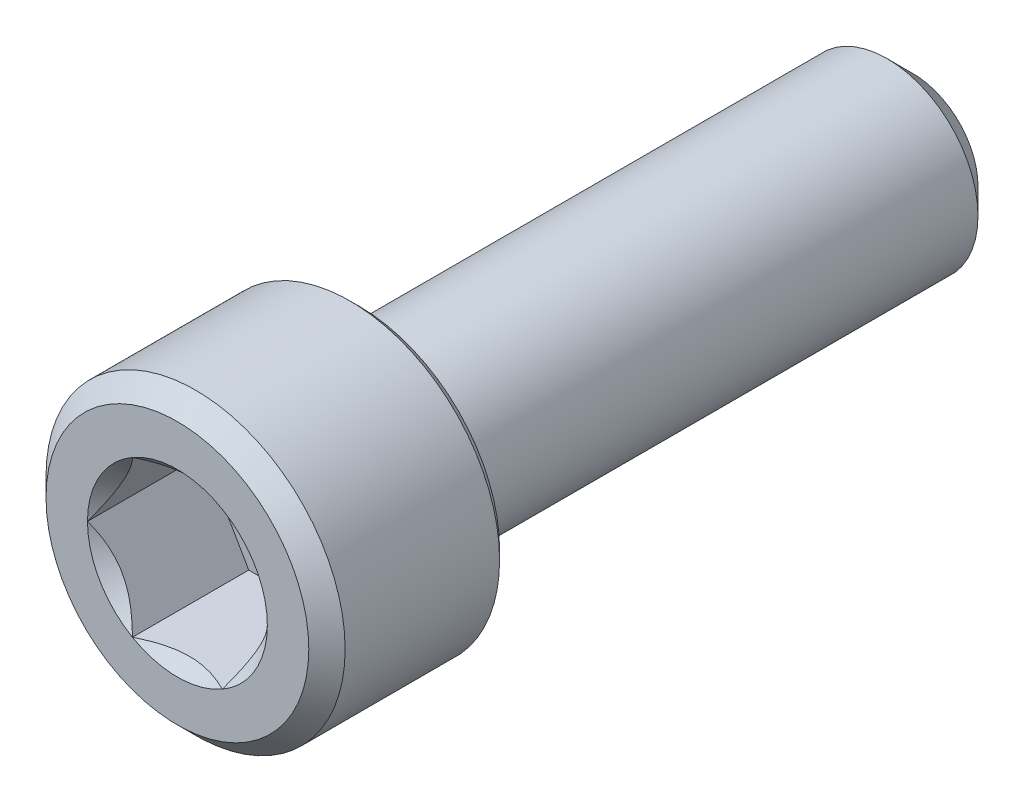
ISO-10303-21;
HEADER;
FILE_DESCRIPTION(('STEP AP214'),'2;1');
FILE_NAME('part.step','',(''),(''),'','','');
FILE_SCHEMA(('AUTOMOTIVE_DESIGN { 1 0 10303 214 1 1 1 1 }'));
ENDSEC;
DATA;
#1=APPLICATION_CONTEXT('core data for automotive mechanical design processes');
#2=APPLICATION_PROTOCOL_DEFINITION('international standard','automotive_design',2000,#1);
#3=PRODUCT_CONTEXT('',#1,'mechanical');
#4=PRODUCT('Part','Part','',(#3));
#5=PRODUCT_RELATED_PRODUCT_CATEGORY('part','',(#4));
#6=PRODUCT_DEFINITION_FORMATION('','',#4);
#7=PRODUCT_DEFINITION_CONTEXT('part definition',#1,'design');
#8=PRODUCT_DEFINITION('design','',#6,#7);
#9=PRODUCT_DEFINITION_SHAPE('','',#8);
#10=(LENGTH_UNIT() NAMED_UNIT(*) SI_UNIT(.MILLI.,.METRE.));
#11=(NAMED_UNIT(*) PLANE_ANGLE_UNIT() SI_UNIT($,.RADIAN.));
#12=(NAMED_UNIT(*) SI_UNIT($,.STERADIAN.) SOLID_ANGLE_UNIT());
#13=UNCERTAINTY_MEASURE_WITH_UNIT(LENGTH_MEASURE(1.E-05),#10,'distance_accuracy_value','');
#14=(GEOMETRIC_REPRESENTATION_CONTEXT(3) GLOBAL_UNCERTAINTY_ASSIGNED_CONTEXT((#13)) GLOBAL_UNIT_ASSIGNED_CONTEXT((#10,
#11,#12)) REPRESENTATION_CONTEXT('',''));
#15=CARTESIAN_POINT('',(0.,0.,0.));
#16=DIRECTION('',(0.,0.,1.));
#17=DIRECTION('',(1.,0.,0.));
#18=AXIS2_PLACEMENT_3D('',#15,#16,#17);
#19=CARTESIAN_POINT('',(0.,0.,14.1986));
#20=DIRECTION('',(0.,0.,1.));
#21=DIRECTION('',(1.,0.,0.));
#22=AXIS2_PLACEMENT_3D('',#19,#20,#21);
#23=PLANE('',#22);
#24=DIRECTION('',(0.5,-0.866025403784438,0.));
#25=VECTOR('',#24,1.);
#26=CARTESIAN_POINT('',(-2.06185637534076,0.,14.1986));
#27=LINE('',#26,#25);
#28=CARTESIAN_POINT('',(-2.06185637534076,0.,14.1986));
#29=VERTEX_POINT('',#28);
#30=CARTESIAN_POINT('',(-1.03092818767038,-1.78562,14.1986));
#31=VERTEX_POINT('',#30);
#32=EDGE_CURVE('E115',#29,#31,#27,.T.);
#33=ORIENTED_EDGE('',*,*,#32,.T.);
#34=DIRECTION('',(1.,0.,0.));
#35=VECTOR('',#34,1.);
#36=CARTESIAN_POINT('',(-1.03092818767038,-1.78562,14.1986));
#37=LINE('',#36,#35);
#38=CARTESIAN_POINT('',(1.03092818767038,-1.78562,14.1986));
#39=VERTEX_POINT('',#38);
#40=EDGE_CURVE('E82',#31,#39,#37,.T.);
#41=ORIENTED_EDGE('',*,*,#40,.T.);
#42=DIRECTION('',(0.5,0.866025403784439,0.));
#43=VECTOR('',#42,1.);
#44=CARTESIAN_POINT('',(1.03092818767038,-1.78562,14.1986));
#45=LINE('',#44,#43);
#46=CARTESIAN_POINT('',(2.06185637534076,0.,14.1986));
#47=VERTEX_POINT('',#46);
#48=EDGE_CURVE('E84',#39,#47,#45,.T.);
#49=ORIENTED_EDGE('',*,*,#48,.T.);
#50=DIRECTION('',(-0.5,0.866025403784439,0.));
#51=VECTOR('',#50,1.);
#52=CARTESIAN_POINT('',(2.06185637534076,0.,14.1986));
#53=LINE('',#52,#51);
#54=CARTESIAN_POINT('',(1.03092818767038,1.78562,14.1986));
#55=VERTEX_POINT('',#54);
#56=EDGE_CURVE('E85',#47,#55,#53,.T.);
#57=ORIENTED_EDGE('',*,*,#56,.T.);
#58=DIRECTION('',(-1.,0.,0.));
#59=VECTOR('',#58,1.);
#60=CARTESIAN_POINT('',(1.03092818767038,1.78562,14.1986));
#61=LINE('',#60,#59);
#62=CARTESIAN_POINT('',(-1.03092818767038,1.78562,14.1986));
#63=VERTEX_POINT('',#62);
#64=EDGE_CURVE('E71',#55,#63,#61,.T.);
#65=ORIENTED_EDGE('',*,*,#64,.T.);
#66=DIRECTION('',(-0.5,-0.866025403784439,0.));
#67=VECTOR('',#66,1.);
#68=CARTESIAN_POINT('',(-1.03092818767038,1.78562,14.1986));
#69=LINE('',#68,#67);
#70=EDGE_CURVE('E110',#63,#29,#69,.T.);
#71=ORIENTED_EDGE('',*,*,#70,.T.);
#72=EDGE_LOOP('',(#33,#41,#49,#57,#65,#71));
#73=FACE_BOUND('',#72,.T.);
#74=ADVANCED_FACE('F17',(#73),#23,.T.);
#75=CARTESIAN_POINT('',(2.06185637534076,0.,14.1986));
#76=DIRECTION('',(0.866025403784439,0.5,0.));
#77=DIRECTION('',(-0.5,0.866025403784439,0.));
#78=AXIS2_PLACEMENT_3D('',#75,#76,#77);
#79=PLANE('',#78);
#80=CARTESIAN_POINT('',(2.06185637533796,3.96750926277853E-11,16.8656000000952));
#81=CARTESIAN_POINT('',(2.02642287006191,0.0613726314457598,16.8302004996147));
#82=CARTESIAN_POINT('',(1.99039691581738,0.123771414579278,16.7968804147174));
#83=CARTESIAN_POINT('',(1.91693629805417,0.251008936893804,16.7358727617142));
#84=CARTESIAN_POINT('',(1.8794946522443,0.315859769757976,16.7082191271544));
#85=CARTESIAN_POINT('',(1.80399541009405,0.446628293096942,16.6608482650098));
#86=CARTESIAN_POINT('',(1.76595703076956,0.512512698723877,16.6410120046867));
#87=CARTESIAN_POINT('',(1.68904308952741,0.645731552765178,16.6104504678516));
#88=CARTESIAN_POINT('',(1.65016987553165,0.713061934459512,16.5997023868589));
#89=CARTESIAN_POINT('',(1.58317010136921,0.829108947404588,16.5900045881446));
#90=CARTESIAN_POINT('',(1.55513003781972,0.877675762119744,16.5885694331519));
#91=CARTESIAN_POINT('',(1.49909578617372,0.974729932934701,16.5909903584037));
#92=CARTESIAN_POINT('',(1.47110161759968,1.02321725522058,16.5948482932734));
#93=CARTESIAN_POINT('',(1.4153853719646,1.11972062346754,16.607634072444));
#94=CARTESIAN_POINT('',(1.38766354395693,1.16773623805551,16.6165661845464));
#95=CARTESIAN_POINT('',(1.33268389704903,1.26296377988218,16.6390154680209));
#96=CARTESIAN_POINT('',(1.30542630540014,1.31017531351003,16.6525348208084));
#97=CARTESIAN_POINT('',(1.23563624997937,1.43105523536186,16.6926550621538));
#98=CARTESIAN_POINT('',(1.19353588652413,1.50397520388344,16.7222754052141));
#99=CARTESIAN_POINT('',(1.13163053077316,1.61119842530475,16.7722771621251));
#100=CARTESIAN_POINT('',(1.11122988525072,1.64653337985682,16.7898452544144));
#101=CARTESIAN_POINT('',(1.07080633251089,1.71654902702464,16.8265826684241));
#102=CARTESIAN_POINT('',(1.0507832028901,1.75123010485439,16.8457510088158));
#103=CARTESIAN_POINT('',(1.03092818768946,1.78561999996696,16.8656000001036));
#104=B_SPLINE_CURVE_WITH_KNOTS('',3,(#80,#81,#82,#83,#84,#85,#86,#87,#88,#89,#90,#91,#92,#93,
#94,#95,#96,#97,#98,#99,#100,#101,#102,#103),.UNSPECIFIED.,.F.,.F.,(4,2,2,2,2,2,2,2,2,2,2,4),
(0.,0.23781413306604,0.477013279258463,0.712414751805986,0.947223776242776,1.11528104356387,
1.28339721085576,1.45165498750335,1.61999288981527,1.88720880273879,2.02045430028471,
2.15361867888886),.UNSPECIFIED.);
#105=CARTESIAN_POINT('',(2.06185637531632,0.,16.8656000000982));
#106=VERTEX_POINT('',#105);
#107=CARTESIAN_POINT('',(1.0309281876314,1.78561999998286,16.8656000000883));
#108=VERTEX_POINT('',#107);
#109=EDGE_CURVE('E20',#106,#108,#104,.T.);
#110=ORIENTED_EDGE('',*,*,#109,.T.);
#111=DIRECTION('',(0.,0.,1.));
#112=VECTOR('',#111,1.);
#113=CARTESIAN_POINT('',(1.03092818767038,1.78562,14.1986));
#114=LINE('',#113,#112);
#115=EDGE_CURVE('E90',#108,#55,#114,.F.);
#116=ORIENTED_EDGE('',*,*,#115,.T.);
#117=ORIENTED_EDGE('',*,*,#56,.F.);
#118=DIRECTION('',(0.,0.,1.));
#119=VECTOR('',#118,1.);
#120=CARTESIAN_POINT('',(2.06185637534076,0.,14.1986));
#121=LINE('',#120,#119);
#122=EDGE_CURVE('E58',#47,#106,#121,.T.);
#123=ORIENTED_EDGE('',*,*,#122,.T.);
#124=EDGE_LOOP('',(#110,#116,#117,#123));
#125=FACE_BOUND('',#124,.T.);
#126=ADVANCED_FACE('F89',(#125),#79,.F.);
#127=CARTESIAN_POINT('',(1.03092818767038,-1.78562,14.1986));
#128=DIRECTION('',(0.866025403784439,-0.5,0.));
#129=DIRECTION('',(0.5,0.866025403784439,0.));
#130=AXIS2_PLACEMENT_3D('',#127,#128,#129);
#131=PLANE('',#130);
#132=CARTESIAN_POINT('',(1.03092818770334,-1.78561999997774,16.8656000000952));
#133=CARTESIAN_POINT('',(1.06636169296008,-1.72424736856051,16.8302004996147));
#134=CARTESIAN_POINT('',(1.10238764719668,-1.66184858542241,16.7968804147174));
#135=CARTESIAN_POINT('',(1.17584826495404,-1.5346110631045,16.7358727617142));
#136=CARTESIAN_POINT('',(1.21328991076606,-1.46976023024157,16.7082191271544));
#137=CARTESIAN_POINT('',(1.28878915291786,-1.3389917069035,16.6608482650098));
#138=CARTESIAN_POINT('',(1.32682753224178,-1.27310730127624,16.6410120046867));
#139=CARTESIAN_POINT('',(1.40374147348352,-1.13988844723471,16.6104504678516));
#140=CARTESIAN_POINT('',(1.44261468747944,-1.07255806554046,16.5997023868589));
#141=CARTESIAN_POINT('',(1.50961446164196,-0.956511052595431,16.5900045881446));
#142=CARTESIAN_POINT('',(1.53765452519143,-0.907944237880261,16.5885694331519));
#143=CARTESIAN_POINT('',(1.59368877683741,-0.810890067065294,16.5909903584037));
#144=CARTESIAN_POINT('',(1.62168294541145,-0.762402744779416,16.5948482932734));
#145=CARTESIAN_POINT('',(1.67739919104654,-0.665899376532457,16.607634072444));
#146=CARTESIAN_POINT('',(1.70512101905421,-0.61788376194449,16.6165661845464));
#147=CARTESIAN_POINT('',(1.76010066596211,-0.522656220117815,16.6390154680209));
#148=CARTESIAN_POINT('',(1.787358257611,-0.475444686489972,16.6525348208084));
#149=CARTESIAN_POINT('',(1.85714831303177,-0.354564764638144,16.6926550621538));
#150=CARTESIAN_POINT('',(1.89924867648701,-0.28164479611656,16.7222754052141));
#151=CARTESIAN_POINT('',(1.96115403223798,-0.174421574695251,16.7722771621251));
#152=CARTESIAN_POINT('',(1.98155467776042,-0.139086620143182,16.7898452544144));
#153=CARTESIAN_POINT('',(2.02197823050024,-0.069070972975363,16.8265826684241));
#154=CARTESIAN_POINT('',(2.04200136012104,-0.0343898951456101,16.8457510088158));
#155=CARTESIAN_POINT('',(2.06185637532168,-3.30436818169415E-11,16.8656000001036));
#156=B_SPLINE_CURVE_WITH_KNOTS('',3,(#132,#133,#134,#135,#136,#137,#138,#139,#140,#141,#142,
#143,#144,#145,#146,#147,#148,#149,#150,#151,#152,#153,#154,#155),.UNSPECIFIED.,.F.,.F.,(4,2,2,
2,2,2,2,2,2,2,2,4),(0.,0.23781413306604,0.477013279258463,0.712414751805985,0.947223776242776,
1.11528104356387,1.28339721085576,1.45165498750335,1.61999288981527,1.88720880273879,
2.02045430028471,2.15361867888886),.UNSPECIFIED.);
#157=CARTESIAN_POINT('',(1.03092818765816,-1.78561999997884,16.8656000000982));
#158=VERTEX_POINT('',#157);
#159=EDGE_CURVE('E94',#158,#106,#156,.T.);
#160=ORIENTED_EDGE('',*,*,#159,.T.);
#161=ORIENTED_EDGE('',*,*,#122,.F.);
#162=ORIENTED_EDGE('',*,*,#48,.F.);
#163=DIRECTION('',(0.,0.,-1.));
#164=VECTOR('',#163,1.);
#165=CARTESIAN_POINT('',(1.03092818767038,-1.78562,14.1986));
#166=LINE('',#165,#164);
#167=EDGE_CURVE('E96',#39,#158,#166,.F.);
#168=ORIENTED_EDGE('',*,*,#167,.T.);
#169=EDGE_LOOP('',(#160,#161,#162,#168));
#170=FACE_BOUND('',#169,.T.);
#171=ADVANCED_FACE('F92',(#170),#131,.F.);
#172=CARTESIAN_POINT('',(-1.03092818767038,-1.78562,14.1986));
#173=DIRECTION('',(0.,-1.,0.));
#174=DIRECTION('',(0.,0.,-1.));
#175=AXIS2_PLACEMENT_3D('',#172,#173,#174);
#176=PLANE('',#175);
#177=CARTESIAN_POINT('',(-1.03092818763462,-1.78562000001741,16.8656000000952));
#178=CARTESIAN_POINT('',(-0.960061177114349,-1.78562000000627,16.8302004996137));
#179=CARTESIAN_POINT('',(-0.888009268645816,-1.78562000000168,16.796880414715));
#180=CARTESIAN_POINT('',(-0.741088033150423,-1.78561999999831,16.7358727617074));
#181=CARTESIAN_POINT('',(-0.666204741541121,-1.78561999999955,16.7082191271447));
#182=CARTESIAN_POINT('',(-0.515206257263572,-1.78562000000044,16.6608482649927));
#183=CARTESIAN_POINT('',(-0.439129498627079,-1.78562000000012,16.641012004665));
#184=CARTESIAN_POINT('',(-0.285301616166403,-1.78561999999988,16.6104504678193));
#185=CARTESIAN_POINT('',(-0.207555188186034,-1.78561999999997,16.5997023868205));
#186=CARTESIAN_POINT('',(-0.0735556398872815,-1.78562000000002,16.5900045880953));
#187=CARTESIAN_POINT('',(-0.0174755128034855,-1.78562,16.5885694330974));
#188=CARTESIAN_POINT('',(0.0945929904587332,-1.78561999999999,16.5909903583372));
#189=CARTESIAN_POINT('',(0.150581327592204,-1.78562,16.5948482931999));
#190=CARTESIAN_POINT('',(0.262013818833841,-1.78562,16.6076340723556));
#191=CARTESIAN_POINT('',(0.317457474835239,-1.78562,16.6165661844499));
#192=CARTESIAN_POINT('',(0.427416768623784,-1.78562,16.6390154679076));
#193=CARTESIAN_POINT('',(0.481931951908255,-1.78562,16.6525348206863));
#194=CARTESIAN_POINT('',(0.621512062793856,-1.78562,16.6926550620308));
#195=CARTESIAN_POINT('',(0.705712789759473,-1.78562,16.722275405108));
#196=CARTESIAN_POINT('',(0.829523501340344,-1.78562,16.772277162053));
#197=CARTESIAN_POINT('',(0.870324792410985,-1.78562,16.7898452543552));
#198=CARTESIAN_POINT('',(0.951171897940881,-1.78562,16.8265826683929));
#199=CARTESIAN_POINT('',(0.991218157206953,-1.78562,16.8457510087998));
#200=CARTESIAN_POINT('',(1.03092818763222,-1.78562,16.8656000001036));
#201=B_SPLINE_CURVE_WITH_KNOTS('',3,(#177,#178,#179,#180,#181,#182,#183,#184,#185,#186,#187,
#188,#189,#190,#191,#192,#193,#194,#195,#196,#197,#198,#199,#200),.UNSPECIFIED.,.F.,.F.,(4,2,2,
2,2,2,2,2,2,2,2,4),(0.,0.2378141330337,0.477013279193779,0.712414751710253,0.947223776116022,
1.11528104339214,1.28339721063898,1.45165498724146,1.61999288950828,1.88720880260309,
2.02045430023521,2.15361867892517),.UNSPECIFIED.);
#202=CARTESIAN_POINT('',(-1.03092818765816,-1.78561999997884,16.8656000000982));
#203=VERTEX_POINT('',#202);
#204=EDGE_CURVE('E197',#203,#158,#201,.T.);
#205=ORIENTED_EDGE('',*,*,#204,.T.);
#206=ORIENTED_EDGE('',*,*,#167,.F.);
#207=ORIENTED_EDGE('',*,*,#40,.F.);
#208=DIRECTION('',(0.,0.,1.));
#209=VECTOR('',#208,1.);
#210=CARTESIAN_POINT('',(-1.03092818767038,-1.78562,14.1986));
#211=LINE('',#210,#209);
#212=EDGE_CURVE('E112',#31,#203,#211,.T.);
#213=ORIENTED_EDGE('',*,*,#212,.T.);
#214=EDGE_LOOP('',(#205,#206,#207,#213));
#215=FACE_BOUND('',#214,.T.);
#216=ADVANCED_FACE('F206',(#215),#176,.F.);
#217=CARTESIAN_POINT('',(-2.06185637534076,0.,14.1986));
#218=DIRECTION('',(-0.866025403784438,-0.5,0.));
#219=DIRECTION('',(0.5,-0.866025403784438,0.));
#220=AXIS2_PLACEMENT_3D('',#217,#218,#219);
#221=PLANE('',#220);
#222=CARTESIAN_POINT('',(-2.06185637533796,-3.96740663487178E-11,16.8656000000952));
#223=CARTESIAN_POINT('',(-2.02642287006191,-0.0613726314457588,16.8302004996147));
#224=CARTESIAN_POINT('',(-1.99039691581738,-0.123771414579277,16.7968804147174));
#225=CARTESIAN_POINT('',(-1.91693629805417,-0.251008936893803,16.7358727617142));
#226=CARTESIAN_POINT('',(-1.8794946522443,-0.315859769757974,16.7082191271544));
#227=CARTESIAN_POINT('',(-1.80399541009405,-0.446628293096941,16.6608482650098));
#228=CARTESIAN_POINT('',(-1.76595703076956,-0.512512698723875,16.6410120046867));
#229=CARTESIAN_POINT('',(-1.68904308952741,-0.645731552765177,16.6104504678516));
#230=CARTESIAN_POINT('',(-1.65016987553165,-0.713061934459511,16.5997023868589));
#231=CARTESIAN_POINT('',(-1.58317010136921,-0.829108947404587,16.5900045881446));
#232=CARTESIAN_POINT('',(-1.55513003781972,-0.877675762119743,16.5885694331519));
#233=CARTESIAN_POINT('',(-1.49909578617372,-0.9747299329347,16.5909903584037));
#234=CARTESIAN_POINT('',(-1.47110161759968,-1.02321725522058,16.5948482932734));
#235=CARTESIAN_POINT('',(-1.4153853719646,-1.11972062346754,16.607634072444));
#236=CARTESIAN_POINT('',(-1.38766354395693,-1.16773623805551,16.6165661845464));
#237=CARTESIAN_POINT('',(-1.33268389704903,-1.26296377988218,16.6390154680209));
#238=CARTESIAN_POINT('',(-1.30542630540014,-1.31017531351003,16.6525348208084));
#239=CARTESIAN_POINT('',(-1.23563624997937,-1.43105523536185,16.6926550621538));
#240=CARTESIAN_POINT('',(-1.19353588652413,-1.50397520388344,16.7222754052141));
#241=CARTESIAN_POINT('',(-1.13163053077316,-1.61119842530475,16.7722771621251));
#242=CARTESIAN_POINT('',(-1.11122988525072,-1.64653337985682,16.7898452544144));
#243=CARTESIAN_POINT('',(-1.07080633251089,-1.71654902702464,16.8265826684241));
#244=CARTESIAN_POINT('',(-1.0507832028901,-1.75123010485439,16.8457510088158));
#245=CARTESIAN_POINT('',(-1.03092818768946,-1.78561999996696,16.8656000001036));
#246=B_SPLINE_CURVE_WITH_KNOTS('',3,(#222,#223,#224,#225,#226,#227,#228,#229,#230,#231,#232,
#233,#234,#235,#236,#237,#238,#239,#240,#241,#242,#243,#244,#245),.UNSPECIFIED.,.F.,.F.,(4,2,2,
2,2,2,2,2,2,2,2,4),(0.,0.237814133066039,0.477013279258462,0.712414751805985,0.947223776242776,
1.11528104356387,1.28339721085576,1.45165498750335,1.61999288981527,1.88720880273879,
2.02045430028471,2.15361867888886),.UNSPECIFIED.);
#247=CARTESIAN_POINT('',(-2.06185637531632,0.,16.8656000000982));
#248=VERTEX_POINT('',#247);
#249=EDGE_CURVE('E190',#248,#203,#246,.T.);
#250=ORIENTED_EDGE('',*,*,#249,.T.);
#251=ORIENTED_EDGE('',*,*,#212,.F.);
#252=ORIENTED_EDGE('',*,*,#32,.F.);
#253=DIRECTION('',(0.,0.,1.));
#254=VECTOR('',#253,1.);
#255=CARTESIAN_POINT('',(-2.06185637534076,0.,14.1986));
#256=LINE('',#255,#254);
#257=EDGE_CURVE('E107',#29,#248,#256,.T.);
#258=ORIENTED_EDGE('',*,*,#257,.T.);
#259=EDGE_LOOP('',(#250,#251,#252,#258));
#260=FACE_BOUND('',#259,.T.);
#261=ADVANCED_FACE('F202',(#260),#221,.F.);
#262=CARTESIAN_POINT('',(-1.03092818767038,1.78562,14.1986));
#263=DIRECTION('',(-0.866025403784439,0.5,0.));
#264=DIRECTION('',(-0.5,-0.866025403784439,0.));
#265=AXIS2_PLACEMENT_3D('',#262,#263,#264);
#266=PLANE('',#265);
#267=CARTESIAN_POINT('',(-1.03092818770334,1.78561999997774,16.8656000000952));
#268=CARTESIAN_POINT('',(-1.06636169296008,1.72424736856051,16.8302004996147));
#269=CARTESIAN_POINT('',(-1.10238764719668,1.66184858542241,16.7968804147174));
#270=CARTESIAN_POINT('',(-1.17584826495404,1.5346110631045,16.7358727617142));
#271=CARTESIAN_POINT('',(-1.21328991076606,1.46976023024157,16.7082191271544));
#272=CARTESIAN_POINT('',(-1.28878915291786,1.3389917069035,16.6608482650098));
#273=CARTESIAN_POINT('',(-1.32682753224178,1.27310730127624,16.6410120046867));
#274=CARTESIAN_POINT('',(-1.40374147348352,1.13988844723471,16.6104504678516));
#275=CARTESIAN_POINT('',(-1.44261468747944,1.07255806554046,16.5997023868589));
#276=CARTESIAN_POINT('',(-1.50961446164196,0.956511052595431,16.5900045881446));
#277=CARTESIAN_POINT('',(-1.53765452519143,0.907944237880262,16.5885694331519));
#278=CARTESIAN_POINT('',(-1.59368877683741,0.810890067065294,16.5909903584037));
#279=CARTESIAN_POINT('',(-1.62168294541145,0.762402744779417,16.5948482932734));
#280=CARTESIAN_POINT('',(-1.67739919104654,0.665899376532457,16.607634072444));
#281=CARTESIAN_POINT('',(-1.70512101905421,0.617883761944491,16.6165661845464));
#282=CARTESIAN_POINT('',(-1.76010066596211,0.522656220117816,16.6390154680209));
#283=CARTESIAN_POINT('',(-1.787358257611,0.475444686489972,16.6525348208084));
#284=CARTESIAN_POINT('',(-1.85714831303177,0.354564764638144,16.6926550621538));
#285=CARTESIAN_POINT('',(-1.89924867648701,0.281644796116561,16.7222754052141));
#286=CARTESIAN_POINT('',(-1.96115403223798,0.174421574695253,16.7722771621251));
#287=CARTESIAN_POINT('',(-1.98155467776042,0.139086620143183,16.7898452544144));
#288=CARTESIAN_POINT('',(-2.02197823050024,0.0690709729753642,16.8265826684241));
#289=CARTESIAN_POINT('',(-2.04200136012104,0.0343898951456116,16.8457510088158));
#290=CARTESIAN_POINT('',(-2.06185637532168,3.30456896158699E-11,16.8656000001036));
#291=B_SPLINE_CURVE_WITH_KNOTS('',3,(#267,#268,#269,#270,#271,#272,#273,#274,#275,#276,#277,
#278,#279,#280,#281,#282,#283,#284,#285,#286,#287,#288,#289,#290),.UNSPECIFIED.,.F.,.F.,(4,2,2,
2,2,2,2,2,2,2,2,4),(0.,0.23781413306604,0.477013279258463,0.712414751805985,0.947223776242776,
1.11528104356387,1.28339721085576,1.45165498750335,1.61999288981527,1.88720880273879,
2.02045430028471,2.15361867888886),.UNSPECIFIED.);
#292=CARTESIAN_POINT('',(-1.03092818765816,1.78561999997884,16.8656000000982));
#293=VERTEX_POINT('',#292);
#294=EDGE_CURVE('E161',#293,#248,#291,.T.);
#295=ORIENTED_EDGE('',*,*,#294,.T.);
#296=ORIENTED_EDGE('',*,*,#257,.F.);
#297=ORIENTED_EDGE('',*,*,#70,.F.);
#298=DIRECTION('',(0.,0.,1.));
#299=VECTOR('',#298,1.);
#300=CARTESIAN_POINT('',(-1.03092818767038,1.78562,14.1986));
#301=LINE('',#300,#299);
#302=EDGE_CURVE('E39',#63,#293,#301,.T.);
#303=ORIENTED_EDGE('',*,*,#302,.T.);
#304=EDGE_LOOP('',(#295,#296,#297,#303));
#305=FACE_BOUND('',#304,.T.);
#306=ADVANCED_FACE('F205',(#305),#266,.F.);
#307=CARTESIAN_POINT('',(1.03092818767038,1.78562,14.1986));
#308=DIRECTION('',(0.,1.,0.));
#309=DIRECTION('',(-1.,0.,0.));
#310=AXIS2_PLACEMENT_3D('',#307,#308,#309);
#311=PLANE('',#310);
#312=CARTESIAN_POINT('',(1.03092818763462,1.78562000001741,16.8656000000952));
#313=CARTESIAN_POINT('',(0.960061177114348,1.78562000000627,16.8302004996137));
#314=CARTESIAN_POINT('',(0.888009268645816,1.78562000000168,16.796880414715));
#315=CARTESIAN_POINT('',(0.741088033150423,1.78561999999831,16.7358727617074));
#316=CARTESIAN_POINT('',(0.666204741541121,1.78561999999955,16.7082191271447));
#317=CARTESIAN_POINT('',(0.515206257263572,1.78562000000044,16.6608482649927));
#318=CARTESIAN_POINT('',(0.439129498627079,1.78562000000012,16.641012004665));
#319=CARTESIAN_POINT('',(0.285301616166403,1.78561999999988,16.6104504678193));
#320=CARTESIAN_POINT('',(0.207555188186033,1.78561999999997,16.5997023868205));
#321=CARTESIAN_POINT('',(0.0735556398872807,1.78562000000002,16.5900045880953));
#322=CARTESIAN_POINT('',(0.0174755128034843,1.78562000000001,16.5885694330974));
#323=CARTESIAN_POINT('',(-0.0945929904587353,1.78561999999999,16.5909903583372));
#324=CARTESIAN_POINT('',(-0.150581327592207,1.78562,16.5948482931999));
#325=CARTESIAN_POINT('',(-0.262013818833845,1.78562,16.6076340723556));
#326=CARTESIAN_POINT('',(-0.317457474835242,1.78562,16.6165661844499));
#327=CARTESIAN_POINT('',(-0.427416768623788,1.78562,16.6390154679076));
#328=CARTESIAN_POINT('',(-0.481931951908259,1.78562,16.6525348206863));
#329=CARTESIAN_POINT('',(-0.62151206279386,1.78562,16.6926550620309));
#330=CARTESIAN_POINT('',(-0.705712789759475,1.78562,16.722275405108));
#331=CARTESIAN_POINT('',(-0.829523501340345,1.78562,16.7722771620531));
#332=CARTESIAN_POINT('',(-0.870324792410987,1.78562,16.7898452543552));
#333=CARTESIAN_POINT('',(-0.951171897940882,1.78562,16.8265826683929));
#334=CARTESIAN_POINT('',(-0.991218157206953,1.78562,16.8457510087998));
#335=CARTESIAN_POINT('',(-1.03092818763222,1.78562,16.8656000001036));
#336=B_SPLINE_CURVE_WITH_KNOTS('',3,(#312,#313,#314,#315,#316,#317,#318,#319,#320,#321,#322,
#323,#324,#325,#326,#327,#328,#329,#330,#331,#332,#333,#334,#335),.UNSPECIFIED.,.F.,.F.,(4,2,2,
2,2,2,2,2,2,2,2,4),(0.,0.237814133033699,0.477013279193778,0.712414751710253,0.947223776116021,
1.11528104339214,1.28339721063898,1.45165498724146,1.61999288950829,1.8872088026031,
2.02045430023521,2.15361867892517),.UNSPECIFIED.);
#337=EDGE_CURVE('E154',#108,#293,#336,.T.);
#338=ORIENTED_EDGE('',*,*,#337,.T.);
#339=ORIENTED_EDGE('',*,*,#302,.F.);
#340=ORIENTED_EDGE('',*,*,#64,.F.);
#341=ORIENTED_EDGE('',*,*,#115,.F.);
#342=EDGE_LOOP('',(#338,#339,#340,#341));
#343=FACE_BOUND('',#342,.T.);
#344=ADVANCED_FACE('F168',(#343),#311,.F.);
#345=CARTESIAN_POINT('',(0.,0.,16.8656000000169));
#346=DIRECTION('',(0.,0.,1.));
#347=DIRECTION('',(1.,0.,0.));
#348=AXIS2_PLACEMENT_3D('',#345,#346,#347);
#349=CONICAL_SURFACE('',#348,2.06185637523504,0.785398163397448);
#350=ORIENTED_EDGE('',*,*,#109,.F.);
#351=CARTESIAN_POINT('',(0.,0.,16.8656000000738));
#352=DIRECTION('',(0.,0.,1.));
#353=DIRECTION('',(1.,0.,0.));
#354=AXIS2_PLACEMENT_3D('',#351,#352,#353);
#355=CIRCLE('',#354,2.06185637529188);
#356=EDGE_CURVE('E151',#108,#106,#355,.F.);
#357=ORIENTED_EDGE('',*,*,#356,.F.);
#358=EDGE_LOOP('',(#350,#357));
#359=FACE_BOUND('',#358,.T.);
#360=ADVANCED_FACE('F222',(#359),#349,.F.);
#361=CARTESIAN_POINT('',(0.,0.,16.8656000000169));
#362=DIRECTION('',(0.,0.,1.));
#363=DIRECTION('',(1.,0.,0.));
#364=AXIS2_PLACEMENT_3D('',#361,#362,#363);
#365=CONICAL_SURFACE('',#364,2.06185637523504,0.785398163397448);
#366=ORIENTED_EDGE('',*,*,#159,.F.);
#367=CARTESIAN_POINT('',(0.,0.,16.8656000000738));
#368=DIRECTION('',(0.,0.,1.));
#369=DIRECTION('',(1.,0.,0.));
#370=AXIS2_PLACEMENT_3D('',#367,#368,#369);
#371=CIRCLE('',#370,2.06185637529188);
#372=EDGE_CURVE('E148',#106,#158,#371,.F.);
#373=ORIENTED_EDGE('',*,*,#372,.F.);
#374=EDGE_LOOP('',(#366,#373));
#375=FACE_BOUND('',#374,.T.);
#376=ADVANCED_FACE('F219',(#375),#365,.F.);
#377=CARTESIAN_POINT('',(0.,0.,16.8656000000169));
#378=DIRECTION('',(0.,0.,1.));
#379=DIRECTION('',(1.,0.,0.));
#380=AXIS2_PLACEMENT_3D('',#377,#378,#379);
#381=CONICAL_SURFACE('',#380,2.06185637523504,0.78539816329518);
#382=ORIENTED_EDGE('',*,*,#204,.F.);
#383=CARTESIAN_POINT('',(0.,0.,16.8656000000738));
#384=DIRECTION('',(0.,0.,1.));
#385=DIRECTION('',(1.,0.,0.));
#386=AXIS2_PLACEMENT_3D('',#383,#384,#385);
#387=CIRCLE('',#386,2.06185637529188);
#388=EDGE_CURVE('E145',#158,#203,#387,.F.);
#389=ORIENTED_EDGE('',*,*,#388,.F.);
#390=EDGE_LOOP('',(#382,#389));
#391=FACE_BOUND('',#390,.T.);
#392=ADVANCED_FACE('F186',(#391),#381,.F.);
#393=CARTESIAN_POINT('',(0.,0.,16.8656000000169));
#394=DIRECTION('',(0.,0.,1.));
#395=DIRECTION('',(1.,0.,0.));
#396=AXIS2_PLACEMENT_3D('',#393,#394,#395);
#397=CONICAL_SURFACE('',#396,2.06185637523504,0.785398163397448);
#398=ORIENTED_EDGE('',*,*,#249,.F.);
#399=CARTESIAN_POINT('',(0.,0.,16.8656000000738));
#400=DIRECTION('',(0.,0.,1.));
#401=DIRECTION('',(1.,0.,0.));
#402=AXIS2_PLACEMENT_3D('',#399,#400,#401);
#403=CIRCLE('',#402,2.06185637529188);
#404=EDGE_CURVE('E142',#203,#248,#403,.F.);
#405=ORIENTED_EDGE('',*,*,#404,.F.);
#406=EDGE_LOOP('',(#398,#405));
#407=FACE_BOUND('',#406,.T.);
#408=ADVANCED_FACE('F181',(#407),#397,.F.);
#409=CARTESIAN_POINT('',(0.,0.,16.8656000000169));
#410=DIRECTION('',(0.,0.,1.));
#411=DIRECTION('',(1.,0.,0.));
#412=AXIS2_PLACEMENT_3D('',#409,#410,#411);
#413=CONICAL_SURFACE('',#412,2.06185637523504,0.785398163397448);
#414=ORIENTED_EDGE('',*,*,#294,.F.);
#415=CARTESIAN_POINT('',(0.,0.,16.8656000000738));
#416=DIRECTION('',(0.,0.,1.));
#417=DIRECTION('',(1.,0.,0.));
#418=AXIS2_PLACEMENT_3D('',#415,#416,#417);
#419=CIRCLE('',#418,2.06185637529188);
#420=EDGE_CURVE('E139',#248,#293,#419,.F.);
#421=ORIENTED_EDGE('',*,*,#420,.F.);
#422=EDGE_LOOP('',(#414,#421));
#423=FACE_BOUND('',#422,.T.);
#424=ADVANCED_FACE('F175',(#423),#413,.F.);
#425=CARTESIAN_POINT('',(0.,0.,16.8656000000169));
#426=DIRECTION('',(0.,0.,1.));
#427=DIRECTION('',(1.,0.,0.));
#428=AXIS2_PLACEMENT_3D('',#425,#426,#427);
#429=CONICAL_SURFACE('',#428,2.06185637523504,0.785398163295182);
#430=ORIENTED_EDGE('',*,*,#337,.F.);
#431=CARTESIAN_POINT('',(0.,0.,16.8656000000738));
#432=DIRECTION('',(0.,0.,1.));
#433=DIRECTION('',(1.,0.,0.));
#434=AXIS2_PLACEMENT_3D('',#431,#432,#433);
#435=CIRCLE('',#434,2.06185637529188);
#436=EDGE_CURVE('E136',#293,#108,#435,.F.);
#437=ORIENTED_EDGE('',*,*,#436,.F.);
#438=EDGE_LOOP('',(#430,#437));
#439=FACE_BOUND('',#438,.T.);
#440=ADVANCED_FACE('F170',(#439),#429,.F.);
#441=CARTESIAN_POINT('',(0.,0.,16.8656));
#442=DIRECTION('',(0.,0.,1.));
#443=DIRECTION('',(1.,0.,0.));
#444=AXIS2_PLACEMENT_3D('',#441,#442,#443);
#445=PLANE('',#444);
#446=CARTESIAN_POINT('',(0.,0.,16.8656000000169));
#447=DIRECTION('',(0.,0.,-1.));
#448=DIRECTION('',(-1.,0.,0.));
#449=AXIS2_PLACEMENT_3D('',#446,#447,#448);
#450=CIRCLE('',#449,3.01243999996359);
#451=CARTESIAN_POINT('',(-3.01243999996359,0.,16.8656000000169));
#452=VERTEX_POINT('',#451);
#453=EDGE_CURVE('E132',#452,#452,#450,.T.);
#454=ORIENTED_EDGE('',*,*,#453,.F.);
#455=EDGE_LOOP('',(#454));
#456=FACE_BOUND('',#455,.T.);
#457=ORIENTED_EDGE('',*,*,#420,.T.);
#458=ORIENTED_EDGE('',*,*,#436,.T.);
#459=ORIENTED_EDGE('',*,*,#356,.T.);
#460=ORIENTED_EDGE('',*,*,#372,.T.);
#461=ORIENTED_EDGE('',*,*,#388,.T.);
#462=ORIENTED_EDGE('',*,*,#404,.T.);
#463=EDGE_LOOP('',(#457,#458,#459,#460,#461,#462));
#464=FACE_BOUND('',#463,.T.);
#465=ADVANCED_FACE('F174',(#456,#464),#445,.T.);
#466=CARTESIAN_POINT('',(0.,0.,16.4490400000545));
#467=DIRECTION('',(0.,0.,-1.));
#468=DIRECTION('',(-1.,0.,0.));
#469=AXIS2_PLACEMENT_3D('',#466,#467,#468);
#470=CONICAL_SURFACE('',#469,3.42899999998281,0.785398163465678);
#471=ORIENTED_EDGE('',*,*,#453,.T.);
#472=EDGE_LOOP('',(#471));
#473=FACE_BOUND('',#472,.T.);
#474=CARTESIAN_POINT('',(0.,0.,16.44904));
#475=DIRECTION('',(0.,0.,-1.));
#476=DIRECTION('',(-1.,0.,0.));
#477=AXIS2_PLACEMENT_3D('',#474,#475,#476);
#478=CIRCLE('',#477,3.429);
#479=CARTESIAN_POINT('',(-3.429,0.,16.44904));
#480=VERTEX_POINT('',#479);
#481=EDGE_CURVE('E135',#480,#480,#478,.T.);
#482=ORIENTED_EDGE('',*,*,#481,.F.);
#483=EDGE_LOOP('',(#482));
#484=FACE_BOUND('',#483,.T.);
#485=ADVANCED_FACE('F258',(#473,#484),#470,.T.);
#486=CARTESIAN_POINT('',(0.,0.,16.8656));
#487=DIRECTION('',(0.,0.,-1.));
#488=DIRECTION('',(-1.,0.,0.));
#489=AXIS2_PLACEMENT_3D('',#486,#487,#488);
#490=CYLINDRICAL_SURFACE('',#489,3.429);
#491=ORIENTED_EDGE('',*,*,#481,.T.);
#492=EDGE_LOOP('',(#491));
#493=FACE_BOUND('',#492,.T.);
#494=CARTESIAN_POINT('',(0.,0.,12.9082800000333));
#495=DIRECTION('',(0.,0.,1.));
#496=DIRECTION('',(1.,0.,0.));
#497=AXIS2_PLACEMENT_3D('',#494,#495,#496);
#498=CIRCLE('',#497,3.42899999998281);
#499=CARTESIAN_POINT('',(3.42899999998281,0.,12.9082800000333));
#500=VERTEX_POINT('',#499);
#501=EDGE_CURVE('E131',#500,#500,#498,.F.);
#502=ORIENTED_EDGE('',*,*,#501,.F.);
#503=EDGE_LOOP('',(#502));
#504=FACE_BOUND('',#503,.T.);
#505=ADVANCED_FACE('F255',(#493,#504),#490,.T.);
#506=CARTESIAN_POINT('',(0.,0.,12.9082800000333));
#507=DIRECTION('',(0.,0.,1.));
#508=DIRECTION('',(0.,-1.,0.));
#509=AXIS2_PLACEMENT_3D('',#506,#507,#508);
#510=CONICAL_SURFACE('',#509,3.42899999998281,0.785398163260989);
#511=CARTESIAN_POINT('',(0.,0.,12.7000000000521));
#512=DIRECTION('',(0.,0.,1.));
#513=DIRECTION('',(0.,-1.,0.));
#514=AXIS2_PLACEMENT_3D('',#511,#512,#513);
#515=CIRCLE('',#514,3.22072000005846);
#516=CARTESIAN_POINT('',(0.,-3.22072000005846,12.7000000000521));
#517=VERTEX_POINT('',#516);
#518=EDGE_CURVE('E128',#517,#517,#515,.T.);
#519=ORIENTED_EDGE('',*,*,#518,.T.);
#520=EDGE_LOOP('',(#519));
#521=FACE_BOUND('',#520,.T.);
#522=ORIENTED_EDGE('',*,*,#501,.T.);
#523=EDGE_LOOP('',(#522));
#524=FACE_BOUND('',#523,.T.);
#525=ADVANCED_FACE('F251',(#521,#524),#510,.T.);
#526=CARTESIAN_POINT('',(0.,0.,0.));
#527=DIRECTION('',(0.,0.,1.));
#528=DIRECTION('',(1.,0.,0.));
#529=AXIS2_PLACEMENT_3D('',#526,#527,#528);
#530=PLANE('',#529);
#531=CARTESIAN_POINT('',(0.,0.,0.));
#532=DIRECTION('',(0.,0.,1.));
#533=DIRECTION('',(1.,0.,0.));
#534=AXIS2_PLACEMENT_3D('',#531,#532,#533);
#535=CIRCLE('',#534,1.48844000005965);
#536=CARTESIAN_POINT('',(1.48844000005965,0.,0.));
#537=VERTEX_POINT('',#536);
#538=EDGE_CURVE('E125',#537,#537,#535,.T.);
#539=ORIENTED_EDGE('',*,*,#538,.F.);
#540=EDGE_LOOP('',(#539));
#541=FACE_BOUND('',#540,.T.);
#542=ADVANCED_FACE('F247',(#541),#530,.F.);
#543=CARTESIAN_POINT('',(0.,0.,12.7));
#544=DIRECTION('',(0.,0.,1.));
#545=DIRECTION('',(1.,0.,0.));
#546=AXIS2_PLACEMENT_3D('',#543,#544,#545);
#547=PLANE('',#546);
#548=CARTESIAN_POINT('',(0.,0.,12.7));
#549=DIRECTION('',(0.,0.,-1.));
#550=DIRECTION('',(-1.,0.,0.));
#551=AXIS2_PLACEMENT_3D('',#548,#549,#550);
#552=CIRCLE('',#551,2.0828);
#553=CARTESIAN_POINT('',(-2.0828,0.,12.7));
#554=VERTEX_POINT('',#553);
#555=EDGE_CURVE('E30',#554,#554,#552,.T.);
#556=ORIENTED_EDGE('',*,*,#555,.F.);
#557=EDGE_LOOP('',(#556));
#558=FACE_BOUND('',#557,.T.);
#559=ORIENTED_EDGE('',*,*,#518,.F.);
#560=EDGE_LOOP('',(#559));
#561=FACE_BOUND('',#560,.T.);
#562=ADVANCED_FACE('F240',(#558,#561),#547,.F.);
#563=CARTESIAN_POINT('',(0.,0.,0.594360000036431));
#564=DIRECTION('',(0.,0.,1.));
#565=DIRECTION('',(1.,0.,0.));
#566=AXIS2_PLACEMENT_3D('',#563,#564,#565);
#567=CONICAL_SURFACE('',#566,2.08280000003924,0.785398163349629);
#568=CARTESIAN_POINT('',(0.,0.,0.594360000000002));
#569=DIRECTION('',(0.,0.,-1.));
#570=DIRECTION('',(-1.,0.,0.));
#571=AXIS2_PLACEMENT_3D('',#568,#569,#570);
#572=CIRCLE('',#571,2.0828);
#573=CARTESIAN_POINT('',(-2.0828,0.,0.594360000000002));
#574=VERTEX_POINT('',#573);
#575=EDGE_CURVE('E11',#574,#574,#572,.F.);
#576=ORIENTED_EDGE('',*,*,#575,.F.);
#577=EDGE_LOOP('',(#576));
#578=FACE_BOUND('',#577,.T.);
#579=ORIENTED_EDGE('',*,*,#538,.T.);
#580=EDGE_LOOP('',(#579));
#581=FACE_BOUND('',#580,.T.);
#582=ADVANCED_FACE('F234',(#578,#581),#567,.T.);
#583=CARTESIAN_POINT('',(0.,0.,12.7));
#584=DIRECTION('',(0.,0.,-1.));
#585=DIRECTION('',(-1.,0.,0.));
#586=AXIS2_PLACEMENT_3D('',#583,#584,#585);
#587=CYLINDRICAL_SURFACE('',#586,2.0828);
#588=ORIENTED_EDGE('',*,*,#575,.T.);
#589=EDGE_LOOP('',(#588));
#590=FACE_BOUND('',#589,.T.);
#591=ORIENTED_EDGE('',*,*,#555,.T.);
#592=EDGE_LOOP('',(#591));
#593=FACE_BOUND('',#592,.T.);
#594=ADVANCED_FACE('F232',(#590,#593),#587,.T.);
#595=CLOSED_SHELL('',(#74,#126,#171,#216,#261,#306,#344,#360,#376,#392,#408,#424,#440,#465,#485,
#505,#525,#542,#562,#582,#594));
#596=MANIFOLD_SOLID_BREP('B1',#595);
#597=ADVANCED_BREP_SHAPE_REPRESENTATION('',(#18,#596),#14);
#598=SHAPE_DEFINITION_REPRESENTATION(#9,#597);
ENDSEC;
END-ISO-10303-21;
